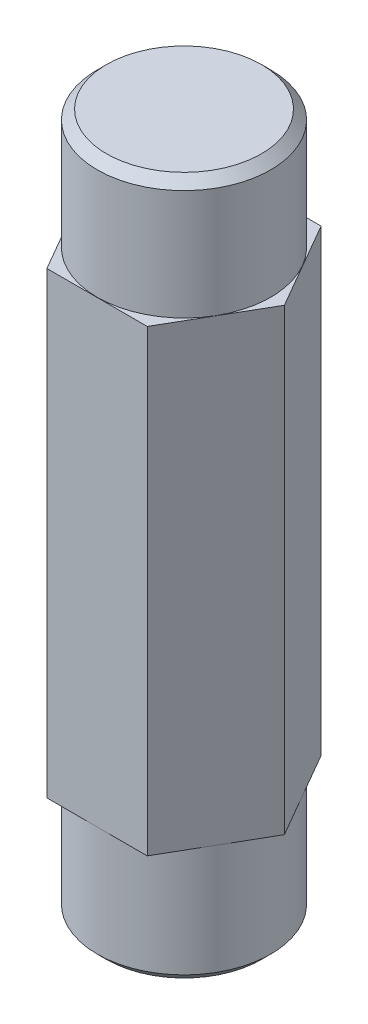
ISO-10303-21;
HEADER;
FILE_DESCRIPTION(('STEP AP214'),'2;1');
FILE_NAME('part.step','',(''),(''),'','','');
FILE_SCHEMA(('AUTOMOTIVE_DESIGN { 1 0 10303 214 1 1 1 1 }'));
ENDSEC;
DATA;
#1=APPLICATION_CONTEXT('core data for automotive mechanical design processes');
#2=APPLICATION_PROTOCOL_DEFINITION('international standard','automotive_design',2000,#1);
#3=PRODUCT_CONTEXT('',#1,'mechanical');
#4=PRODUCT('Part','Part','',(#3));
#5=PRODUCT_RELATED_PRODUCT_CATEGORY('part','',(#4));
#6=PRODUCT_DEFINITION_FORMATION('','',#4);
#7=PRODUCT_DEFINITION_CONTEXT('part definition',#1,'design');
#8=PRODUCT_DEFINITION('design','',#6,#7);
#9=PRODUCT_DEFINITION_SHAPE('','',#8);
#10=(LENGTH_UNIT() NAMED_UNIT(*) SI_UNIT(.MILLI.,.METRE.));
#11=(NAMED_UNIT(*) PLANE_ANGLE_UNIT() SI_UNIT($,.RADIAN.));
#12=(NAMED_UNIT(*) SI_UNIT($,.STERADIAN.) SOLID_ANGLE_UNIT());
#13=UNCERTAINTY_MEASURE_WITH_UNIT(LENGTH_MEASURE(1.E-05),#10,'distance_accuracy_value','');
#14=(GEOMETRIC_REPRESENTATION_CONTEXT(3) GLOBAL_UNCERTAINTY_ASSIGNED_CONTEXT((#13)) GLOBAL_UNIT_ASSIGNED_CONTEXT((#10,
#11,#12)) REPRESENTATION_CONTEXT('',''));
#15=CARTESIAN_POINT('',(0.,0.,0.));
#16=DIRECTION('',(0.,0.,1.));
#17=DIRECTION('',(1.,0.,0.));
#18=AXIS2_PLACEMENT_3D('',#15,#16,#17);
#19=CARTESIAN_POINT('',(-39.2241243202131,6.35,-16.6661167863655));
#20=DIRECTION('',(0.,-1.,0.));
#21=DIRECTION('',(0.,0.,-1.));
#22=AXIS2_PLACEMENT_3D('',#19,#20,#21);
#23=PLANE('',#22);
#24=CARTESIAN_POINT('',(-39.2241243202131,6.34999999994079,-16.6661167863655));
#25=DIRECTION('',(0.,-1.,0.));
#26=DIRECTION('',(0.,0.,-1.));
#27=AXIS2_PLACEMENT_3D('',#24,#25,#26);
#28=CIRCLE('',#27,4.24180000000514);
#29=CARTESIAN_POINT('',(-39.2241243202131,6.34999999994079,-20.9079167863706));
#30=VERTEX_POINT('',#29);
#31=EDGE_CURVE('E20',#30,#30,#28,.T.);
#32=ORIENTED_EDGE('',*,*,#31,.F.);
#33=EDGE_LOOP('',(#32));
#34=FACE_BOUND('',#33,.T.);
#35=ADVANCED_FACE('F17',(#34),#23,.F.);
#36=CARTESIAN_POINT('',(-39.2241243202131,-31.877,-16.6661167863655));
#37=DIRECTION('',(0.,1.,0.));
#38=DIRECTION('',(0.,0.,1.));
#39=AXIS2_PLACEMENT_3D('',#36,#37,#38);
#40=PLANE('',#39);
#41=CARTESIAN_POINT('',(-39.2241243202131,-31.8769999999517,-16.6661167863655));
#42=DIRECTION('',(0.,1.,0.));
#43=DIRECTION('',(0.,0.,1.));
#44=AXIS2_PLACEMENT_3D('',#41,#42,#43);
#45=CIRCLE('',#44,4.24180000002854);
#46=CARTESIAN_POINT('',(-39.2241243202131,-31.8769999999517,-12.4243167863369));
#47=VERTEX_POINT('',#46);
#48=EDGE_CURVE('E109',#47,#47,#45,.T.);
#49=ORIENTED_EDGE('',*,*,#48,.F.);
#50=EDGE_LOOP('',(#49));
#51=FACE_BOUND('',#50,.T.);
#52=ADVANCED_FACE('F121',(#51),#40,.F.);
#53=CARTESIAN_POINT('',(-39.2241243202131,5.8420000000865,-16.6661167863655));
#54=DIRECTION('',(0.,-1.,0.));
#55=DIRECTION('',(0.,0.,-1.));
#56=AXIS2_PLACEMENT_3D('',#53,#54,#55);
#57=CONICAL_SURFACE('',#56,4.74979999991627,0.785398163453397);
#58=CARTESIAN_POINT('',(-39.2241243202131,5.842,-16.6661167863655));
#59=DIRECTION('',(0.,-1.,0.));
#60=DIRECTION('',(0.,0.,-1.));
#61=AXIS2_PLACEMENT_3D('',#58,#59,#60);
#62=CIRCLE('',#61,4.7498);
#63=CARTESIAN_POINT('',(-39.2241243202131,5.842,-21.4159167863655));
#64=VERTEX_POINT('',#63);
#65=EDGE_CURVE('E106',#64,#64,#62,.T.);
#66=ORIENTED_EDGE('',*,*,#65,.F.);
#67=EDGE_LOOP('',(#66));
#68=FACE_BOUND('',#67,.T.);
#69=ORIENTED_EDGE('',*,*,#31,.T.);
#70=EDGE_LOOP('',(#69));
#71=FACE_BOUND('',#70,.T.);
#72=ADVANCED_FACE('F118',(#68,#71),#57,.T.);
#73=CARTESIAN_POINT('',(-39.2241243202131,-31.3689999999838,-16.6661167863655));
#74=DIRECTION('',(0.,1.,0.));
#75=DIRECTION('',(0.,0.,1.));
#76=AXIS2_PLACEMENT_3D('',#73,#74,#75);
#77=CONICAL_SURFACE('',#76,4.74980000005336,0.785398163453397);
#78=CARTESIAN_POINT('',(-39.2241243202131,-31.369,-16.6661167863655));
#79=DIRECTION('',(0.,1.,0.));
#80=DIRECTION('',(0.,0.,1.));
#81=AXIS2_PLACEMENT_3D('',#78,#79,#80);
#82=CIRCLE('',#81,4.7498);
#83=CARTESIAN_POINT('',(-39.2241243202131,-31.369,-11.9163167863655));
#84=VERTEX_POINT('',#83);
#85=EDGE_CURVE('E79',#84,#84,#82,.T.);
#86=ORIENTED_EDGE('',*,*,#85,.F.);
#87=EDGE_LOOP('',(#86));
#88=FACE_BOUND('',#87,.T.);
#89=ORIENTED_EDGE('',*,*,#48,.T.);
#90=EDGE_LOOP('',(#89));
#91=FACE_BOUND('',#90,.T.);
#92=ADVANCED_FACE('F163',(#88,#91),#77,.T.);
#93=CARTESIAN_POINT('',(-39.2241243202131,6.35,-16.6661167863655));
#94=DIRECTION('',(0.,-1.,0.));
#95=DIRECTION('',(0.,0.,-1.));
#96=AXIS2_PLACEMENT_3D('',#93,#94,#95);
#97=CYLINDRICAL_SURFACE('',#96,4.7498);
#98=CARTESIAN_POINT('',(-39.2241243202131,-0.2032,-16.6661167863655));
#99=DIRECTION('',(0.,-1.,0.));
#100=DIRECTION('',(0.,0.,-1.));
#101=AXIS2_PLACEMENT_3D('',#98,#99,#100);
#102=CIRCLE('',#101,4.7498);
#103=CARTESIAN_POINT('',(-39.2241243202131,-0.2032,-21.4159167863655));
#104=VERTEX_POINT('',#103);
#105=EDGE_CURVE('E95',#104,#104,#102,.T.);
#106=ORIENTED_EDGE('',*,*,#105,.F.);
#107=EDGE_LOOP('',(#106));
#108=FACE_BOUND('',#107,.T.);
#109=ORIENTED_EDGE('',*,*,#65,.T.);
#110=EDGE_LOOP('',(#109));
#111=FACE_BOUND('',#110,.T.);
#112=ADVANCED_FACE('F159',(#108,#111),#97,.T.);
#113=CARTESIAN_POINT('',(-39.2241243202131,-31.877,-16.6661167863655));
#114=DIRECTION('',(0.,1.,0.));
#115=DIRECTION('',(0.,0.,1.));
#116=AXIS2_PLACEMENT_3D('',#113,#114,#115);
#117=CYLINDRICAL_SURFACE('',#116,4.7498);
#118=CARTESIAN_POINT('',(-39.2241243202131,-25.3238,-16.6661167863655));
#119=DIRECTION('',(0.,1.,0.));
#120=DIRECTION('',(0.,0.,1.));
#121=AXIS2_PLACEMENT_3D('',#118,#119,#120);
#122=CIRCLE('',#121,4.7498);
#123=CARTESIAN_POINT('',(-39.2241243202131,-25.3238,-11.9163167863655));
#124=VERTEX_POINT('',#123);
#125=EDGE_CURVE('E110',#124,#124,#122,.T.);
#126=ORIENTED_EDGE('',*,*,#125,.F.);
#127=EDGE_LOOP('',(#126));
#128=FACE_BOUND('',#127,.T.);
#129=ORIENTED_EDGE('',*,*,#85,.T.);
#130=EDGE_LOOP('',(#129));
#131=FACE_BOUND('',#130,.T.);
#132=ADVANCED_FACE('F156',(#128,#131),#117,.T.);
#133=CARTESIAN_POINT('',(-44.7233856342443,-25.527,-16.6661167863655));
#134=DIRECTION('',(-0.866025403784439,0.,0.5));
#135=DIRECTION('',(0.5,0.,0.866025403784439));
#136=AXIS2_PLACEMENT_3D('',#133,#134,#135);
#137=PLANE('',#136);
#138=DIRECTION('',(0.,1.,0.));
#139=VECTOR('',#138,1.);
#140=CARTESIAN_POINT('',(-44.7233856342443,-25.527,-16.6661167863655));
#141=LINE('',#140,#139);
#142=CARTESIAN_POINT('',(-44.7233856342443,-25.3238,-16.6661167863655));
#143=VERTEX_POINT('',#142);
#144=CARTESIAN_POINT('',(-44.7233856342443,-0.2032,-16.6661167863655));
#145=VERTEX_POINT('',#144);
#146=EDGE_CURVE('E70',#143,#145,#141,.T.);
#147=ORIENTED_EDGE('',*,*,#146,.F.);
#148=DIRECTION('',(-0.5,0.,-0.866025403784439));
#149=VECTOR('',#148,1.);
#150=CARTESIAN_POINT('',(-41.9737549772287,-25.3238,-11.9036167863655));
#151=LINE('',#150,#149);
#152=CARTESIAN_POINT('',(-41.9737549772287,-25.3238,-11.9036167863655));
#153=VERTEX_POINT('',#152);
#154=EDGE_CURVE('E274',#153,#143,#151,.T.);
#155=ORIENTED_EDGE('',*,*,#154,.F.);
#156=DIRECTION('',(0.,1.,0.));
#157=VECTOR('',#156,1.);
#158=CARTESIAN_POINT('',(-41.9737549772287,-25.527,-11.9036167863655));
#159=LINE('',#158,#157);
#160=CARTESIAN_POINT('',(-41.9737549772287,-0.2032,-11.9036167863655));
#161=VERTEX_POINT('',#160);
#162=EDGE_CURVE('E84',#161,#153,#159,.F.);
#163=ORIENTED_EDGE('',*,*,#162,.F.);
#164=DIRECTION('',(0.5,0.,0.866025403784439));
#165=VECTOR('',#164,1.);
#166=CARTESIAN_POINT('',(-44.7233856342443,-0.2032,-16.6661167863655));
#167=LINE('',#166,#165);
#168=EDGE_CURVE('E82',#145,#161,#167,.T.);
#169=ORIENTED_EDGE('',*,*,#168,.F.);
#170=EDGE_LOOP('',(#147,#155,#163,#169));
#171=FACE_BOUND('',#170,.T.);
#172=ADVANCED_FACE('F83',(#171),#137,.T.);
#173=CARTESIAN_POINT('',(-41.9737549772287,-25.527,-21.4286167863655));
#174=DIRECTION('',(-0.866025403784438,0.,-0.500000000000001));
#175=DIRECTION('',(-0.500000000000001,0.,0.866025403784438));
#176=AXIS2_PLACEMENT_3D('',#173,#174,#175);
#177=PLANE('',#176);
#178=DIRECTION('',(0.,1.,0.));
#179=VECTOR('',#178,1.);
#180=CARTESIAN_POINT('',(-41.9737549772287,-25.527,-21.4286167863655));
#181=LINE('',#180,#179);
#182=CARTESIAN_POINT('',(-41.9737549772287,-25.3238,-21.4286167863655));
#183=VERTEX_POINT('',#182);
#184=CARTESIAN_POINT('',(-41.9737549772287,-0.2032,-21.4286167863655));
#185=VERTEX_POINT('',#184);
#186=EDGE_CURVE('E78',#183,#185,#181,.T.);
#187=ORIENTED_EDGE('',*,*,#186,.F.);
#188=DIRECTION('',(0.500000000000001,0.,-0.866025403784438));
#189=VECTOR('',#188,1.);
#190=CARTESIAN_POINT('',(-44.7233856342443,-25.3238,-16.6661167863655));
#191=LINE('',#190,#189);
#192=EDGE_CURVE('E74',#143,#183,#191,.T.);
#193=ORIENTED_EDGE('',*,*,#192,.F.);
#194=ORIENTED_EDGE('',*,*,#146,.T.);
#195=DIRECTION('',(-0.500000000000001,0.,0.866025403784438));
#196=VECTOR('',#195,1.);
#197=CARTESIAN_POINT('',(-41.9737549772287,-0.2032,-21.4286167863655));
#198=LINE('',#197,#196);
#199=EDGE_CURVE('E67',#185,#145,#198,.T.);
#200=ORIENTED_EDGE('',*,*,#199,.F.);
#201=EDGE_LOOP('',(#187,#193,#194,#200));
#202=FACE_BOUND('',#201,.T.);
#203=ADVANCED_FACE('F72',(#202),#177,.T.);
#204=CARTESIAN_POINT('',(-36.4744936631975,-25.527,-21.4286167863655));
#205=DIRECTION('',(0.,0.,-1.));
#206=DIRECTION('',(-1.,0.,0.));
#207=AXIS2_PLACEMENT_3D('',#204,#205,#206);
#208=PLANE('',#207);
#209=DIRECTION('',(0.,1.,0.));
#210=VECTOR('',#209,1.);
#211=CARTESIAN_POINT('',(-36.4744936631975,-25.527,-21.4286167863655));
#212=LINE('',#211,#210);
#213=CARTESIAN_POINT('',(-36.4744936631975,-25.3238,-21.4286167863655));
#214=VERTEX_POINT('',#213);
#215=CARTESIAN_POINT('',(-36.4744936631975,-0.2032,-21.4286167863655));
#216=VERTEX_POINT('',#215);
#217=EDGE_CURVE('E98',#214,#216,#212,.T.);
#218=ORIENTED_EDGE('',*,*,#217,.F.);
#219=DIRECTION('',(1.,0.,0.));
#220=VECTOR('',#219,1.);
#221=CARTESIAN_POINT('',(-41.9737549772287,-25.3238,-21.4286167863655));
#222=LINE('',#221,#220);
#223=EDGE_CURVE('E267',#183,#214,#222,.T.);
#224=ORIENTED_EDGE('',*,*,#223,.F.);
#225=ORIENTED_EDGE('',*,*,#186,.T.);
#226=DIRECTION('',(1.,0.,0.));
#227=VECTOR('',#226,1.);
#228=CARTESIAN_POINT('',(-44.7233856342443,-0.2032,-21.4286167863655));
#229=LINE('',#228,#227);
#230=EDGE_CURVE('E94',#216,#185,#229,.F.);
#231=ORIENTED_EDGE('',*,*,#230,.F.);
#232=EDGE_LOOP('',(#218,#224,#225,#231));
#233=FACE_BOUND('',#232,.T.);
#234=ADVANCED_FACE('F147',(#233),#208,.T.);
#235=CARTESIAN_POINT('',(-33.7248630061819,-25.527,-16.6661167863655));
#236=DIRECTION('',(0.866025403784439,0.,-0.5));
#237=DIRECTION('',(-0.5,0.,-0.866025403784439));
#238=AXIS2_PLACEMENT_3D('',#235,#236,#237);
#239=PLANE('',#238);
#240=DIRECTION('',(0.,1.,0.));
#241=VECTOR('',#240,1.);
#242=CARTESIAN_POINT('',(-33.7248630061819,-25.527,-16.6661167863655));
#243=LINE('',#242,#241);
#244=CARTESIAN_POINT('',(-33.7248630061819,-25.3238,-16.6661167863655));
#245=VERTEX_POINT('',#244);
#246=CARTESIAN_POINT('',(-33.7248630061819,-0.2032,-16.6661167863655));
#247=VERTEX_POINT('',#246);
#248=EDGE_CURVE('E271',#245,#247,#243,.T.);
#249=ORIENTED_EDGE('',*,*,#248,.F.);
#250=DIRECTION('',(0.5,0.,0.866025403784439));
#251=VECTOR('',#250,1.);
#252=CARTESIAN_POINT('',(-36.4744936631975,-25.3238,-21.4286167863655));
#253=LINE('',#252,#251);
#254=EDGE_CURVE('E269',#214,#245,#253,.T.);
#255=ORIENTED_EDGE('',*,*,#254,.F.);
#256=ORIENTED_EDGE('',*,*,#217,.T.);
#257=DIRECTION('',(-0.5,0.,-0.866025403784439));
#258=VECTOR('',#257,1.);
#259=CARTESIAN_POINT('',(-33.7248630061819,-0.2032,-16.6661167863655));
#260=LINE('',#259,#258);
#261=EDGE_CURVE('E87',#247,#216,#260,.T.);
#262=ORIENTED_EDGE('',*,*,#261,.F.);
#263=EDGE_LOOP('',(#249,#255,#256,#262));
#264=FACE_BOUND('',#263,.T.);
#265=ADVANCED_FACE('F144',(#264),#239,.T.);
#266=CARTESIAN_POINT('',(-44.7233856342443,-0.2032,-16.6661167863655));
#267=DIRECTION('',(0.,1.,0.));
#268=DIRECTION('',(0.,0.,1.));
#269=AXIS2_PLACEMENT_3D('',#266,#267,#268);
#270=PLANE('',#269);
#271=ORIENTED_EDGE('',*,*,#261,.T.);
#272=ORIENTED_EDGE('',*,*,#230,.T.);
#273=ORIENTED_EDGE('',*,*,#199,.T.);
#274=ORIENTED_EDGE('',*,*,#168,.T.);
#275=DIRECTION('',(1.,0.,0.));
#276=VECTOR('',#275,1.);
#277=CARTESIAN_POINT('',(-41.9737549772287,-0.203200000000001,-11.9036167863655));
#278=LINE('',#277,#276);
#279=CARTESIAN_POINT('',(-36.4744936631975,-0.2032,-11.9036167863655));
#280=VERTEX_POINT('',#279);
#281=EDGE_CURVE('E281',#280,#161,#278,.F.);
#282=ORIENTED_EDGE('',*,*,#281,.F.);
#283=DIRECTION('',(0.500000000000001,0.,-0.866025403784438));
#284=VECTOR('',#283,1.);
#285=CARTESIAN_POINT('',(-36.4744936631975,-0.203200000000001,-11.9036167863655));
#286=LINE('',#285,#284);
#287=EDGE_CURVE('E285',#247,#280,#286,.F.);
#288=ORIENTED_EDGE('',*,*,#287,.F.);
#289=EDGE_LOOP('',(#271,#272,#273,#274,#282,#288));
#290=FACE_BOUND('',#289,.T.);
#291=ORIENTED_EDGE('',*,*,#105,.T.);
#292=EDGE_LOOP('',(#291));
#293=FACE_BOUND('',#292,.T.);
#294=ADVANCED_FACE('F91',(#290,#293),#270,.T.);
#295=CARTESIAN_POINT('',(-41.9737549772287,-25.527,-11.9036167863655));
#296=DIRECTION('',(0.,0.,1.));
#297=DIRECTION('',(1.,0.,0.));
#298=AXIS2_PLACEMENT_3D('',#295,#296,#297);
#299=PLANE('',#298);
#300=ORIENTED_EDGE('',*,*,#162,.T.);
#301=DIRECTION('',(1.,0.,0.));
#302=VECTOR('',#301,1.);
#303=CARTESIAN_POINT('',(-41.9737549772287,-25.3238,-11.9036167863655));
#304=LINE('',#303,#302);
#305=CARTESIAN_POINT('',(-36.4744936631975,-25.3238,-11.9036167863655));
#306=VERTEX_POINT('',#305);
#307=EDGE_CURVE('E35',#306,#153,#304,.F.);
#308=ORIENTED_EDGE('',*,*,#307,.F.);
#309=DIRECTION('',(0.,1.,0.));
#310=VECTOR('',#309,1.);
#311=CARTESIAN_POINT('',(-36.4744936631975,-25.527,-11.9036167863655));
#312=LINE('',#311,#310);
#313=EDGE_CURVE('E26',#280,#306,#312,.F.);
#314=ORIENTED_EDGE('',*,*,#313,.F.);
#315=ORIENTED_EDGE('',*,*,#281,.T.);
#316=EDGE_LOOP('',(#300,#308,#314,#315));
#317=FACE_BOUND('',#316,.T.);
#318=ADVANCED_FACE('F135',(#317),#299,.T.);
#319=CARTESIAN_POINT('',(-41.9737549772287,-25.3238,-11.9036167863655));
#320=DIRECTION('',(0.,-1.,0.));
#321=DIRECTION('',(0.,0.,-1.));
#322=AXIS2_PLACEMENT_3D('',#319,#320,#321);
#323=PLANE('',#322);
#324=ORIENTED_EDGE('',*,*,#254,.T.);
#325=DIRECTION('',(0.500000000000001,0.,-0.866025403784438));
#326=VECTOR('',#325,1.);
#327=CARTESIAN_POINT('',(-36.4744936631975,-25.3238,-11.9036167863655));
#328=LINE('',#327,#326);
#329=EDGE_CURVE('E11',#306,#245,#328,.T.);
#330=ORIENTED_EDGE('',*,*,#329,.F.);
#331=ORIENTED_EDGE('',*,*,#307,.T.);
#332=ORIENTED_EDGE('',*,*,#154,.T.);
#333=ORIENTED_EDGE('',*,*,#192,.T.);
#334=ORIENTED_EDGE('',*,*,#223,.T.);
#335=EDGE_LOOP('',(#324,#330,#331,#332,#333,#334));
#336=FACE_BOUND('',#335,.T.);
#337=ORIENTED_EDGE('',*,*,#125,.T.);
#338=EDGE_LOOP('',(#337));
#339=FACE_BOUND('',#338,.T.);
#340=ADVANCED_FACE('F129',(#336,#339),#323,.T.);
#341=CARTESIAN_POINT('',(-36.4744936631975,-25.527,-11.9036167863655));
#342=DIRECTION('',(0.866025403784438,0.,0.500000000000001));
#343=DIRECTION('',(0.500000000000001,0.,-0.866025403784438));
#344=AXIS2_PLACEMENT_3D('',#341,#342,#343);
#345=PLANE('',#344);
#346=ORIENTED_EDGE('',*,*,#313,.T.);
#347=ORIENTED_EDGE('',*,*,#329,.T.);
#348=ORIENTED_EDGE('',*,*,#248,.T.);
#349=ORIENTED_EDGE('',*,*,#287,.T.);
#350=EDGE_LOOP('',(#346,#347,#348,#349));
#351=FACE_BOUND('',#350,.T.);
#352=ADVANCED_FACE('F127',(#351),#345,.T.);
#353=CLOSED_SHELL('',(#35,#52,#72,#92,#112,#132,#172,#203,#234,#265,#294,#318,#340,#352));
#354=MANIFOLD_SOLID_BREP('B1',#353);
#355=ADVANCED_BREP_SHAPE_REPRESENTATION('',(#18,#354),#14);
#356=SHAPE_DEFINITION_REPRESENTATION(#9,#355);
ENDSEC;
END-ISO-10303-21;
